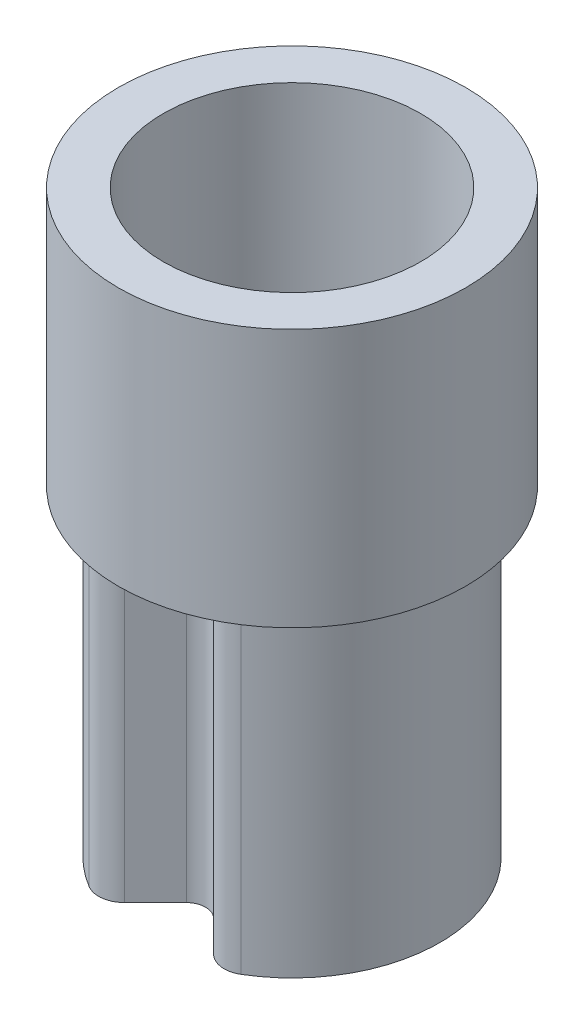
ISO-10303-21;
HEADER;
FILE_DESCRIPTION(('STEP AP214'),'2;1');
FILE_NAME('part.step','',(''),(''),'','','');
FILE_SCHEMA(('AUTOMOTIVE_DESIGN { 1 0 10303 214 1 1 1 1 }'));
ENDSEC;
DATA;
#1=APPLICATION_CONTEXT('core data for automotive mechanical design processes');
#2=APPLICATION_PROTOCOL_DEFINITION('international standard','automotive_design',2000,#1);
#3=PRODUCT_CONTEXT('',#1,'mechanical');
#4=PRODUCT('Part','Part','',(#3));
#5=PRODUCT_RELATED_PRODUCT_CATEGORY('part','',(#4));
#6=PRODUCT_DEFINITION_FORMATION('','',#4);
#7=PRODUCT_DEFINITION_CONTEXT('part definition',#1,'design');
#8=PRODUCT_DEFINITION('design','',#6,#7);
#9=PRODUCT_DEFINITION_SHAPE('','',#8);
#10=(LENGTH_UNIT() NAMED_UNIT(*) SI_UNIT(.MILLI.,.METRE.));
#11=(NAMED_UNIT(*) PLANE_ANGLE_UNIT() SI_UNIT($,.RADIAN.));
#12=(NAMED_UNIT(*) SI_UNIT($,.STERADIAN.) SOLID_ANGLE_UNIT());
#13=UNCERTAINTY_MEASURE_WITH_UNIT(LENGTH_MEASURE(1.E-05),#10,'distance_accuracy_value','');
#14=(GEOMETRIC_REPRESENTATION_CONTEXT(3) GLOBAL_UNCERTAINTY_ASSIGNED_CONTEXT((#13)) GLOBAL_UNIT_ASSIGNED_CONTEXT((#10,
#11,#12)) REPRESENTATION_CONTEXT('',''));
#15=CARTESIAN_POINT('',(0.,0.,0.));
#16=DIRECTION('',(0.,0.,1.));
#17=DIRECTION('',(1.,0.,0.));
#18=AXIS2_PLACEMENT_3D('',#15,#16,#17);
#19=CARTESIAN_POINT('',(0.,2.5,0.822132034355964));
#20=DIRECTION('',(0.,1.,0.));
#21=DIRECTION('',(0.,0.,1.));
#22=AXIS2_PLACEMENT_3D('',#19,#20,#21);
#23=PLANE('',#22);
#24=DIRECTION('',(0.707106781186548,0.,0.707106781186548));
#25=VECTOR('',#24,1.);
#26=CARTESIAN_POINT('',(0.106066017177983,2.5,0.716066017177983));
#27=LINE('',#26,#25);
#28=CARTESIAN_POINT('',(0.106066017177983,2.5,0.716066017177983));
#29=VERTEX_POINT('',#28);
#30=CARTESIAN_POINT('',(0.332945922473057,2.5,0.942945922473057));
#31=VERTEX_POINT('',#30);
#32=EDGE_CURVE('E168',#29,#31,#27,.T.);
#33=ORIENTED_EDGE('',*,*,#32,.T.);
#34=CARTESIAN_POINT('',(0.,2.5,0.));
#35=DIRECTION('',(0.,1.,0.));
#36=DIRECTION('',(0.,0.,1.));
#37=AXIS2_PLACEMENT_3D('',#34,#35,#36);
#38=CIRCLE('',#37,1.);
#39=CARTESIAN_POINT('',(0.513633561053512,2.5,0.858009653185492));
#40=VERTEX_POINT('',#39);
#41=EDGE_CURVE('E151',#31,#40,#38,.T.);
#42=ORIENTED_EDGE('',*,*,#41,.T.);
#43=CARTESIAN_POINT('',(0.487951883000837,2.5,0.815109170526217));
#44=DIRECTION('',(0.,1.,0.));
#45=DIRECTION('',(0.,0.,1.));
#46=AXIS2_PLACEMENT_3D('',#43,#44,#45);
#47=CIRCLE('',#46,0.05);
#48=CARTESIAN_POINT('',(0.452596543941509,2.5,0.850464509585545));
#49=VERTEX_POINT('',#48);
#50=EDGE_CURVE('E208',#40,#49,#47,.F.);
#51=ORIENTED_EDGE('',*,*,#50,.T.);
#52=DIRECTION('',(0.707106781186548,0.,0.707106781186547));
#53=VECTOR('',#52,1.);
#54=CARTESIAN_POINT('',(0.212132034355966,2.5,0.610000000000001));
#55=LINE('',#54,#53);
#56=CARTESIAN_POINT('',(0.212132034355966,2.5,0.610000000000002));
#57=VERTEX_POINT('',#56);
#58=EDGE_CURVE('E241',#57,#49,#55,.T.);
#59=ORIENTED_EDGE('',*,*,#58,.F.);
#60=CARTESIAN_POINT('',(0.,2.5,0.822132034355964));
#61=DIRECTION('',(0.,-1.,0.));
#62=DIRECTION('',(0.,0.,1.));
#63=AXIS2_PLACEMENT_3D('',#60,#61,#62);
#64=CIRCLE('',#63,0.3);
#65=CARTESIAN_POINT('',(-0.212132034355965,2.5,0.610000000000001));
#66=VERTEX_POINT('',#65);
#67=EDGE_CURVE('E237',#66,#57,#64,.T.);
#68=ORIENTED_EDGE('',*,*,#67,.F.);
#69=DIRECTION('',(0.707106781186547,0.,-0.707106781186548));
#70=VECTOR('',#69,1.);
#71=CARTESIAN_POINT('',(-0.479612456619358,2.5,0.877480422263394));
#72=LINE('',#71,#70);
#73=CARTESIAN_POINT('',(-0.452596543941509,2.5,0.850464509585545));
#74=VERTEX_POINT('',#73);
#75=EDGE_CURVE('E235',#74,#66,#72,.T.);
#76=ORIENTED_EDGE('',*,*,#75,.F.);
#77=CARTESIAN_POINT('',(-0.487951883000836,2.5,0.815109170526217));
#78=DIRECTION('',(0.,1.,0.));
#79=DIRECTION('',(0.,0.,1.));
#80=AXIS2_PLACEMENT_3D('',#77,#78,#79);
#81=CIRCLE('',#80,0.05);
#82=CARTESIAN_POINT('',(-0.513633561053512,2.5,0.858009653185492));
#83=VERTEX_POINT('',#82);
#84=EDGE_CURVE('E211',#74,#83,#81,.F.);
#85=ORIENTED_EDGE('',*,*,#84,.T.);
#86=CARTESIAN_POINT('',(-0.332945922473057,2.5,0.942945922473057));
#87=VERTEX_POINT('',#86);
#88=EDGE_CURVE('E14',#83,#87,#38,.T.);
#89=ORIENTED_EDGE('',*,*,#88,.T.);
#90=DIRECTION('',(0.707106781186547,0.,-0.707106781186548));
#91=VECTOR('',#90,1.);
#92=CARTESIAN_POINT('',(-0.448807004477936,2.5,1.05880700447794));
#93=LINE('',#92,#91);
#94=CARTESIAN_POINT('',(-0.106066017177983,2.5,0.716066017177983));
#95=VERTEX_POINT('',#94);
#96=EDGE_CURVE('E178',#87,#95,#93,.T.);
#97=ORIENTED_EDGE('',*,*,#96,.T.);
#98=CARTESIAN_POINT('',(0.,2.5,0.822132034355964));
#99=DIRECTION('',(0.,-1.,0.));
#100=DIRECTION('',(0.,0.,1.));
#101=AXIS2_PLACEMENT_3D('',#98,#99,#100);
#102=CIRCLE('',#101,0.15);
#103=EDGE_CURVE('E173',#95,#29,#102,.T.);
#104=ORIENTED_EDGE('',*,*,#103,.T.);
#105=EDGE_LOOP('',(#33,#42,#51,#59,#68,#76,#85,#89,#97,#104));
#106=FACE_BOUND('',#105,.T.);
#107=ADVANCED_FACE('F50',(#106),#23,.T.);
#108=CARTESIAN_POINT('',(0.,0.,0.822132034355964));
#109=DIRECTION('',(0.,1.,0.));
#110=DIRECTION('',(0.,0.,1.));
#111=AXIS2_PLACEMENT_3D('',#108,#109,#110);
#112=PLANE('',#111);
#113=CARTESIAN_POINT('',(0.,0.,0.));
#114=DIRECTION('',(0.,1.,0.));
#115=DIRECTION('',(0.,0.,1.));
#116=AXIS2_PLACEMENT_3D('',#113,#114,#115);
#117=CIRCLE('',#116,1.15);
#118=CARTESIAN_POINT('',(0.590678595211539,0.,0.986711101163316));
#119=VERTEX_POINT('',#118);
#120=CARTESIAN_POINT('',(-0.590678595211538,0.,0.986711101163316));
#121=VERTEX_POINT('',#120);
#122=EDGE_CURVE('E191',#119,#121,#117,.T.);
#123=ORIENTED_EDGE('',*,*,#122,.F.);
#124=CARTESIAN_POINT('',(0.487951883000837,0.,0.815109170526217));
#125=DIRECTION('',(0.,1.,0.));
#126=DIRECTION('',(0.,0.,1.));
#127=AXIS2_PLACEMENT_3D('',#124,#125,#126);
#128=CIRCLE('',#127,0.2);
#129=CARTESIAN_POINT('',(0.346530526763527,0.,0.956530526763527));
#130=VERTEX_POINT('',#129);
#131=EDGE_CURVE('E75',#119,#130,#128,.F.);
#132=ORIENTED_EDGE('',*,*,#131,.T.);
#133=DIRECTION('',(0.707106781186548,0.,0.707106781186548));
#134=VECTOR('',#133,1.);
#135=CARTESIAN_POINT('',(0.106066017177983,0.,0.716066017177983));
#136=LINE('',#135,#134);
#137=CARTESIAN_POINT('',(0.106066017177983,0.,0.716066017177983));
#138=VERTEX_POINT('',#137);
#139=EDGE_CURVE('E188',#138,#130,#136,.T.);
#140=ORIENTED_EDGE('',*,*,#139,.F.);
#141=CARTESIAN_POINT('',(0.,0.,0.822132034355964));
#142=DIRECTION('',(0.,-1.,0.));
#143=DIRECTION('',(0.,0.,1.));
#144=AXIS2_PLACEMENT_3D('',#141,#142,#143);
#145=CIRCLE('',#144,0.15);
#146=CARTESIAN_POINT('',(-0.106066017177983,0.,0.716066017177983));
#147=VERTEX_POINT('',#146);
#148=EDGE_CURVE('E185',#147,#138,#145,.T.);
#149=ORIENTED_EDGE('',*,*,#148,.F.);
#150=DIRECTION('',(0.707106781186547,0.,-0.707106781186548));
#151=VECTOR('',#150,1.);
#152=CARTESIAN_POINT('',(-0.448807004477936,0.,1.05880700447794));
#153=LINE('',#152,#151);
#154=CARTESIAN_POINT('',(-0.346530526763527,0.,0.956530526763527));
#155=VERTEX_POINT('',#154);
#156=EDGE_CURVE('E194',#155,#147,#153,.T.);
#157=ORIENTED_EDGE('',*,*,#156,.F.);
#158=CARTESIAN_POINT('',(-0.487951883000836,0.,0.815109170526217));
#159=DIRECTION('',(0.,1.,0.));
#160=DIRECTION('',(0.,0.,1.));
#161=AXIS2_PLACEMENT_3D('',#158,#159,#160);
#162=CIRCLE('',#161,0.2);
#163=EDGE_CURVE('E218',#155,#121,#162,.F.);
#164=ORIENTED_EDGE('',*,*,#163,.T.);
#165=EDGE_LOOP('',(#123,#132,#140,#149,#157,#164));
#166=FACE_BOUND('',#165,.T.);
#167=DIRECTION('',(0.707106781186548,0.,0.707106781186547));
#168=VECTOR('',#167,1.);
#169=CARTESIAN_POINT('',(0.212132034355966,0.,0.610000000000001));
#170=LINE('',#169,#168);
#171=CARTESIAN_POINT('',(0.212132034355966,0.,0.610000000000002));
#172=VERTEX_POINT('',#171);
#173=CARTESIAN_POINT('',(0.452596543941509,0.,0.850464509585545));
#174=VERTEX_POINT('',#173);
#175=EDGE_CURVE('E238',#172,#174,#170,.T.);
#176=ORIENTED_EDGE('',*,*,#175,.T.);
#177=CARTESIAN_POINT('',(0.487951883000837,0.,0.815109170526217));
#178=DIRECTION('',(0.,1.,0.));
#179=DIRECTION('',(0.,0.,1.));
#180=AXIS2_PLACEMENT_3D('',#177,#178,#179);
#181=CIRCLE('',#180,0.05);
#182=CARTESIAN_POINT('',(0.513633561053512,0.,0.858009653185492));
#183=VERTEX_POINT('',#182);
#184=EDGE_CURVE('E206',#174,#183,#181,.T.);
#185=ORIENTED_EDGE('',*,*,#184,.T.);
#186=CARTESIAN_POINT('',(0.,0.,0.));
#187=DIRECTION('',(0.,1.,0.));
#188=DIRECTION('',(0.,0.,1.));
#189=AXIS2_PLACEMENT_3D('',#186,#187,#188);
#190=CIRCLE('',#189,1.);
#191=CARTESIAN_POINT('',(-0.513633561053512,0.,0.858009653185492));
#192=VERTEX_POINT('',#191);
#193=EDGE_CURVE('E245',#183,#192,#190,.T.);
#194=ORIENTED_EDGE('',*,*,#193,.T.);
#195=CARTESIAN_POINT('',(-0.487951883000836,0.,0.815109170526217));
#196=DIRECTION('',(0.,1.,0.));
#197=DIRECTION('',(0.,0.,1.));
#198=AXIS2_PLACEMENT_3D('',#195,#196,#197);
#199=CIRCLE('',#198,0.05);
#200=CARTESIAN_POINT('',(-0.452596543941509,0.,0.850464509585545));
#201=VERTEX_POINT('',#200);
#202=EDGE_CURVE('E209',#192,#201,#199,.T.);
#203=ORIENTED_EDGE('',*,*,#202,.T.);
#204=DIRECTION('',(0.707106781186547,0.,-0.707106781186548));
#205=VECTOR('',#204,1.);
#206=CARTESIAN_POINT('',(-0.479612456619358,0.,0.877480422263394));
#207=LINE('',#206,#205);
#208=CARTESIAN_POINT('',(-0.212132034355965,0.,0.610000000000001));
#209=VERTEX_POINT('',#208);
#210=EDGE_CURVE('E248',#201,#209,#207,.T.);
#211=ORIENTED_EDGE('',*,*,#210,.T.);
#212=CARTESIAN_POINT('',(0.,0.,0.822132034355964));
#213=DIRECTION('',(0.,-1.,0.));
#214=DIRECTION('',(0.,0.,1.));
#215=AXIS2_PLACEMENT_3D('',#212,#213,#214);
#216=CIRCLE('',#215,0.3);
#217=EDGE_CURVE('E251',#209,#172,#216,.T.);
#218=ORIENTED_EDGE('',*,*,#217,.T.);
#219=EDGE_LOOP('',(#176,#185,#194,#203,#211,#218));
#220=FACE_BOUND('',#219,.T.);
#221=ADVANCED_FACE('F269',(#166,#220),#112,.F.);
#222=CARTESIAN_POINT('',(0.,2.5,0.822132034355964));
#223=DIRECTION('',(0.,-1.,0.));
#224=DIRECTION('',(0.,0.,-1.));
#225=AXIS2_PLACEMENT_3D('',#222,#223,#224);
#226=CYLINDRICAL_SURFACE('',#225,0.15);
#227=ORIENTED_EDGE('',*,*,#148,.T.);
#228=DIRECTION('',(0.,-1.,0.));
#229=VECTOR('',#228,1.);
#230=CARTESIAN_POINT('',(0.106066017177983,2.5,0.716066017177983));
#231=LINE('',#230,#229);
#232=EDGE_CURVE('E198',#29,#138,#231,.T.);
#233=ORIENTED_EDGE('',*,*,#232,.F.);
#234=ORIENTED_EDGE('',*,*,#103,.F.);
#235=DIRECTION('',(0.,-1.,0.));
#236=VECTOR('',#235,1.);
#237=CARTESIAN_POINT('',(-0.106066017177983,2.5,0.716066017177983));
#238=LINE('',#237,#236);
#239=EDGE_CURVE('E184',#95,#147,#238,.T.);
#240=ORIENTED_EDGE('',*,*,#239,.T.);
#241=EDGE_LOOP('',(#227,#233,#234,#240));
#242=FACE_BOUND('',#241,.T.);
#243=ADVANCED_FACE('F305',(#242),#226,.F.);
#244=CARTESIAN_POINT('',(0.106066017177983,2.5,0.716066017177983));
#245=DIRECTION('',(0.707106781186548,0.,-0.707106781186548));
#246=DIRECTION('',(-0.707106781186548,0.,-0.707106781186548));
#247=AXIS2_PLACEMENT_3D('',#244,#245,#246);
#248=PLANE('',#247);
#249=ORIENTED_EDGE('',*,*,#139,.T.);
#250=DIRECTION('',(0.,-1.,0.));
#251=VECTOR('',#250,1.);
#252=CARTESIAN_POINT('',(0.346530526763527,2.5,0.956530526763527));
#253=LINE('',#252,#251);
#254=CARTESIAN_POINT('',(0.346530526763527,2.5,0.956530526763527));
#255=VERTEX_POINT('',#254);
#256=EDGE_CURVE('E171',#130,#255,#253,.F.);
#257=ORIENTED_EDGE('',*,*,#256,.T.);
#258=EDGE_CURVE('E147',#31,#255,#27,.T.);
#259=ORIENTED_EDGE('',*,*,#258,.F.);
#260=ORIENTED_EDGE('',*,*,#32,.F.);
#261=ORIENTED_EDGE('',*,*,#232,.T.);
#262=EDGE_LOOP('',(#249,#257,#259,#260,#261));
#263=FACE_BOUND('',#262,.T.);
#264=ADVANCED_FACE('F166',(#263),#248,.F.);
#265=CARTESIAN_POINT('',(0.,2.5,0.));
#266=DIRECTION('',(0.,-1.,0.));
#267=DIRECTION('',(0.,0.,-1.));
#268=AXIS2_PLACEMENT_3D('',#265,#266,#267);
#269=CYLINDRICAL_SURFACE('',#268,1.15);
#270=CARTESIAN_POINT('',(0.,2.5,0.));
#271=DIRECTION('',(0.,1.,0.));
#272=DIRECTION('',(0.,0.,1.));
#273=AXIS2_PLACEMENT_3D('',#270,#271,#272);
#274=CIRCLE('',#273,1.15);
#275=CARTESIAN_POINT('',(0.590678595211539,2.5,0.986711101163316));
#276=VERTEX_POINT('',#275);
#277=CARTESIAN_POINT('',(-0.590678595211538,2.5,0.986711101163316));
#278=VERTEX_POINT('',#277);
#279=EDGE_CURVE('E177',#276,#278,#274,.T.);
#280=ORIENTED_EDGE('',*,*,#279,.F.);
#281=DIRECTION('',(0.,-1.,0.));
#282=VECTOR('',#281,1.);
#283=CARTESIAN_POINT('',(0.590678595211539,2.5,0.986711101163316));
#284=LINE('',#283,#282);
#285=EDGE_CURVE('E215',#276,#119,#284,.T.);
#286=ORIENTED_EDGE('',*,*,#285,.T.);
#287=ORIENTED_EDGE('',*,*,#122,.T.);
#288=DIRECTION('',(0.,-1.,0.));
#289=VECTOR('',#288,1.);
#290=CARTESIAN_POINT('',(-0.590678595211539,2.5,0.986711101163316));
#291=LINE('',#290,#289);
#292=EDGE_CURVE('E212',#121,#278,#291,.F.);
#293=ORIENTED_EDGE('',*,*,#292,.T.);
#294=EDGE_LOOP('',(#280,#286,#287,#293));
#295=FACE_BOUND('',#294,.T.);
#296=ADVANCED_FACE('F313',(#295),#269,.T.);
#297=CARTESIAN_POINT('',(-0.448807004477936,2.5,1.05880700447794));
#298=DIRECTION('',(-0.707106781186548,0.,-0.707106781186547));
#299=DIRECTION('',(-0.707106781186547,0.,0.707106781186548));
#300=AXIS2_PLACEMENT_3D('',#297,#298,#299);
#301=PLANE('',#300);
#302=CARTESIAN_POINT('',(-0.346530526763527,2.5,0.956530526763527));
#303=VERTEX_POINT('',#302);
#304=EDGE_CURVE('E150',#303,#87,#93,.T.);
#305=ORIENTED_EDGE('',*,*,#304,.F.);
#306=DIRECTION('',(0.,-1.,0.));
#307=VECTOR('',#306,1.);
#308=CARTESIAN_POINT('',(-0.346530526763527,2.5,0.956530526763527));
#309=LINE('',#308,#307);
#310=EDGE_CURVE('E59',#303,#155,#309,.T.);
#311=ORIENTED_EDGE('',*,*,#310,.T.);
#312=ORIENTED_EDGE('',*,*,#156,.T.);
#313=ORIENTED_EDGE('',*,*,#239,.F.);
#314=ORIENTED_EDGE('',*,*,#96,.F.);
#315=EDGE_LOOP('',(#305,#311,#312,#313,#314));
#316=FACE_BOUND('',#315,.T.);
#317=ADVANCED_FACE('F310',(#316),#301,.F.);
#318=CARTESIAN_POINT('',(0.,2.5,0.));
#319=DIRECTION('',(0.,-1.,0.));
#320=DIRECTION('',(0.,0.,-1.));
#321=AXIS2_PLACEMENT_3D('',#318,#319,#320);
#322=CYLINDRICAL_SURFACE('',#321,1.);
#323=ORIENTED_EDGE('',*,*,#193,.F.);
#324=DIRECTION('',(0.,-1.,0.));
#325=VECTOR('',#324,1.);
#326=CARTESIAN_POINT('',(0.513633561053512,2.5,0.858009653185492));
#327=LINE('',#326,#325);
#328=EDGE_CURVE('E159',#183,#40,#327,.F.);
#329=ORIENTED_EDGE('',*,*,#328,.T.);
#330=ORIENTED_EDGE('',*,*,#41,.F.);
#331=EDGE_CURVE('E67',#87,#31,#38,.T.);
#332=ORIENTED_EDGE('',*,*,#331,.F.);
#333=ORIENTED_EDGE('',*,*,#88,.F.);
#334=DIRECTION('',(0.,-1.,0.));
#335=VECTOR('',#334,1.);
#336=CARTESIAN_POINT('',(-0.513633561053512,2.5,0.858009653185492));
#337=LINE('',#336,#335);
#338=EDGE_CURVE('E203',#83,#192,#337,.T.);
#339=ORIENTED_EDGE('',*,*,#338,.T.);
#340=EDGE_LOOP('',(#323,#329,#330,#332,#333,#339));
#341=FACE_BOUND('',#340,.T.);
#342=CARTESIAN_POINT('',(0.,4.51,0.));
#343=DIRECTION('',(0.,1.,0.));
#344=DIRECTION('',(0.,0.,1.));
#345=AXIS2_PLACEMENT_3D('',#342,#343,#344);
#346=CIRCLE('',#345,1.);
#347=CARTESIAN_POINT('',(0.,4.51,1.));
#348=VERTEX_POINT('',#347);
#349=EDGE_CURVE('E152',#348,#348,#346,.T.);
#350=ORIENTED_EDGE('',*,*,#349,.T.);
#351=EDGE_LOOP('',(#350));
#352=FACE_BOUND('',#351,.T.);
#353=ADVANCED_FACE('F156',(#341,#352),#322,.F.);
#354=CARTESIAN_POINT('',(-0.479612456619358,2.5,0.877480422263394));
#355=DIRECTION('',(-0.707106781186548,0.,-0.707106781186547));
#356=DIRECTION('',(-0.707106781186547,0.,0.707106781186548));
#357=AXIS2_PLACEMENT_3D('',#354,#355,#356);
#358=PLANE('',#357);
#359=ORIENTED_EDGE('',*,*,#210,.F.);
#360=DIRECTION('',(0.,1.,0.));
#361=VECTOR('',#360,1.);
#362=CARTESIAN_POINT('',(-0.452596543941509,2.5,0.850464509585545));
#363=LINE('',#362,#361);
#364=EDGE_CURVE('E204',#201,#74,#363,.T.);
#365=ORIENTED_EDGE('',*,*,#364,.T.);
#366=ORIENTED_EDGE('',*,*,#75,.T.);
#367=DIRECTION('',(0.,-1.,0.));
#368=VECTOR('',#367,1.);
#369=CARTESIAN_POINT('',(-0.212132034355965,2.5,0.610000000000001));
#370=LINE('',#369,#368);
#371=EDGE_CURVE('E189',#66,#209,#370,.T.);
#372=ORIENTED_EDGE('',*,*,#371,.T.);
#373=EDGE_LOOP('',(#359,#365,#366,#372));
#374=FACE_BOUND('',#373,.T.);
#375=ADVANCED_FACE('F261',(#374),#358,.T.);
#376=CARTESIAN_POINT('',(0.,2.5,0.822132034355964));
#377=DIRECTION('',(0.,-1.,0.));
#378=DIRECTION('',(0.,0.,-1.));
#379=AXIS2_PLACEMENT_3D('',#376,#377,#378);
#380=CYLINDRICAL_SURFACE('',#379,0.3);
#381=ORIENTED_EDGE('',*,*,#217,.F.);
#382=ORIENTED_EDGE('',*,*,#371,.F.);
#383=ORIENTED_EDGE('',*,*,#67,.T.);
#384=DIRECTION('',(0.,-1.,0.));
#385=VECTOR('',#384,1.);
#386=CARTESIAN_POINT('',(0.212132034355966,2.5,0.610000000000002));
#387=LINE('',#386,#385);
#388=EDGE_CURVE('E244',#57,#172,#387,.T.);
#389=ORIENTED_EDGE('',*,*,#388,.T.);
#390=EDGE_LOOP('',(#381,#382,#383,#389));
#391=FACE_BOUND('',#390,.T.);
#392=ADVANCED_FACE('F266',(#391),#380,.T.);
#393=CARTESIAN_POINT('',(0.212132034355966,2.5,0.610000000000001));
#394=DIRECTION('',(0.707106781186547,0.,-0.707106781186548));
#395=DIRECTION('',(-0.707106781186548,0.,-0.707106781186547));
#396=AXIS2_PLACEMENT_3D('',#393,#394,#395);
#397=PLANE('',#396);
#398=ORIENTED_EDGE('',*,*,#58,.T.);
#399=DIRECTION('',(0.,1.,0.));
#400=VECTOR('',#399,1.);
#401=CARTESIAN_POINT('',(0.452596543941509,0.,0.850464509585545));
#402=LINE('',#401,#400);
#403=EDGE_CURVE('E200',#49,#174,#402,.F.);
#404=ORIENTED_EDGE('',*,*,#403,.T.);
#405=ORIENTED_EDGE('',*,*,#175,.F.);
#406=ORIENTED_EDGE('',*,*,#388,.F.);
#407=EDGE_LOOP('',(#398,#404,#405,#406));
#408=FACE_BOUND('',#407,.T.);
#409=ADVANCED_FACE('F288',(#408),#397,.T.);
#410=CARTESIAN_POINT('',(0.487951883000837,2.5,0.815109170526217));
#411=DIRECTION('',(0.,-1.,0.));
#412=DIRECTION('',(0.,0.,-1.));
#413=AXIS2_PLACEMENT_3D('',#410,#411,#412);
#414=CYLINDRICAL_SURFACE('',#413,0.05);
#415=ORIENTED_EDGE('',*,*,#50,.F.);
#416=ORIENTED_EDGE('',*,*,#328,.F.);
#417=ORIENTED_EDGE('',*,*,#184,.F.);
#418=ORIENTED_EDGE('',*,*,#403,.F.);
#419=EDGE_LOOP('',(#415,#416,#417,#418));
#420=FACE_BOUND('',#419,.T.);
#421=ADVANCED_FACE('F289',(#420),#414,.F.);
#422=CARTESIAN_POINT('',(-0.487951883000836,2.5,0.815109170526217));
#423=DIRECTION('',(0.,-1.,0.));
#424=DIRECTION('',(0.,0.,-1.));
#425=AXIS2_PLACEMENT_3D('',#422,#423,#424);
#426=CYLINDRICAL_SURFACE('',#425,0.05);
#427=ORIENTED_EDGE('',*,*,#84,.F.);
#428=ORIENTED_EDGE('',*,*,#364,.F.);
#429=ORIENTED_EDGE('',*,*,#202,.F.);
#430=ORIENTED_EDGE('',*,*,#338,.F.);
#431=EDGE_LOOP('',(#427,#428,#429,#430));
#432=FACE_BOUND('',#431,.T.);
#433=ADVANCED_FACE('F274',(#432),#426,.F.);
#434=CARTESIAN_POINT('',(0.487951883000837,2.5,0.815109170526217));
#435=DIRECTION('',(0.,-1.,0.));
#436=DIRECTION('',(0.,0.,-1.));
#437=AXIS2_PLACEMENT_3D('',#434,#435,#436);
#438=CYLINDRICAL_SURFACE('',#437,0.2);
#439=CARTESIAN_POINT('',(0.487951883000837,2.5,0.815109170526217));
#440=DIRECTION('',(0.,1.,0.));
#441=DIRECTION('',(0.,0.,1.));
#442=AXIS2_PLACEMENT_3D('',#439,#440,#441);
#443=CIRCLE('',#442,0.2);
#444=EDGE_CURVE('E224',#255,#276,#443,.T.);
#445=ORIENTED_EDGE('',*,*,#444,.F.);
#446=ORIENTED_EDGE('',*,*,#256,.F.);
#447=ORIENTED_EDGE('',*,*,#131,.F.);
#448=ORIENTED_EDGE('',*,*,#285,.F.);
#449=EDGE_LOOP('',(#445,#446,#447,#448));
#450=FACE_BOUND('',#449,.T.);
#451=ADVANCED_FACE('F296',(#450),#438,.T.);
#452=CARTESIAN_POINT('',(-0.487951883000836,2.5,0.815109170526217));
#453=DIRECTION('',(0.,-1.,0.));
#454=DIRECTION('',(0.,0.,-1.));
#455=AXIS2_PLACEMENT_3D('',#452,#453,#454);
#456=CYLINDRICAL_SURFACE('',#455,0.2);
#457=CARTESIAN_POINT('',(-0.487951883000836,2.5,0.815109170526217));
#458=DIRECTION('',(0.,1.,0.));
#459=DIRECTION('',(0.,0.,1.));
#460=AXIS2_PLACEMENT_3D('',#457,#458,#459);
#461=CIRCLE('',#460,0.2);
#462=EDGE_CURVE('E222',#278,#303,#461,.T.);
#463=ORIENTED_EDGE('',*,*,#462,.F.);
#464=ORIENTED_EDGE('',*,*,#292,.F.);
#465=ORIENTED_EDGE('',*,*,#163,.F.);
#466=ORIENTED_EDGE('',*,*,#310,.F.);
#467=EDGE_LOOP('',(#463,#464,#465,#466));
#468=FACE_BOUND('',#467,.T.);
#469=ADVANCED_FACE('F52',(#468),#456,.T.);
#470=CARTESIAN_POINT('',(0.,2.5,0.));
#471=DIRECTION('',(0.,1.,0.));
#472=DIRECTION('',(0.,0.,1.));
#473=AXIS2_PLACEMENT_3D('',#470,#471,#472);
#474=PLANE('',#473);
#475=CARTESIAN_POINT('',(0.,2.5,0.));
#476=DIRECTION('',(0.,1.,0.));
#477=DIRECTION('',(0.,0.,1.));
#478=AXIS2_PLACEMENT_3D('',#475,#476,#477);
#479=CIRCLE('',#478,1.35);
#480=CARTESIAN_POINT('',(0.,2.5,1.35));
#481=VERTEX_POINT('',#480);
#482=EDGE_CURVE('E163',#481,#481,#479,.T.);
#483=ORIENTED_EDGE('',*,*,#482,.F.);
#484=EDGE_LOOP('',(#483));
#485=FACE_BOUND('',#484,.T.);
#486=ORIENTED_EDGE('',*,*,#331,.T.);
#487=ORIENTED_EDGE('',*,*,#258,.T.);
#488=ORIENTED_EDGE('',*,*,#444,.T.);
#489=ORIENTED_EDGE('',*,*,#279,.T.);
#490=ORIENTED_EDGE('',*,*,#462,.T.);
#491=ORIENTED_EDGE('',*,*,#304,.T.);
#492=EDGE_LOOP('',(#486,#487,#488,#489,#490,#491));
#493=FACE_BOUND('',#492,.T.);
#494=ADVANCED_FACE('F145',(#485,#493),#474,.F.);
#495=CARTESIAN_POINT('',(0.,12.8383766184074,0.));
#496=DIRECTION('',(0.,-1.,0.));
#497=DIRECTION('',(0.,0.,-1.));
#498=AXIS2_PLACEMENT_3D('',#495,#496,#497);
#499=CYLINDRICAL_SURFACE('',#498,1.35);
#500=ORIENTED_EDGE('',*,*,#482,.T.);
#501=EDGE_LOOP('',(#500));
#502=FACE_BOUND('',#501,.T.);
#503=CARTESIAN_POINT('',(0.,4.51,0.));
#504=DIRECTION('',(0.,1.,0.));
#505=DIRECTION('',(0.,0.,1.));
#506=AXIS2_PLACEMENT_3D('',#503,#504,#505);
#507=CIRCLE('',#506,1.35);
#508=CARTESIAN_POINT('',(0.,4.51,1.35));
#509=VERTEX_POINT('',#508);
#510=EDGE_CURVE('E249',#509,#509,#507,.T.);
#511=ORIENTED_EDGE('',*,*,#510,.F.);
#512=EDGE_LOOP('',(#511));
#513=FACE_BOUND('',#512,.T.);
#514=ADVANCED_FACE('F339',(#502,#513),#499,.T.);
#515=CARTESIAN_POINT('',(0.,4.51,0.822132034355964));
#516=DIRECTION('',(0.,1.,0.));
#517=DIRECTION('',(0.,0.,1.));
#518=AXIS2_PLACEMENT_3D('',#515,#516,#517);
#519=PLANE('',#518);
#520=ORIENTED_EDGE('',*,*,#349,.F.);
#521=EDGE_LOOP('',(#520));
#522=FACE_BOUND('',#521,.T.);
#523=ORIENTED_EDGE('',*,*,#510,.T.);
#524=EDGE_LOOP('',(#523));
#525=FACE_BOUND('',#524,.T.);
#526=ADVANCED_FACE('F421',(#522,#525),#519,.T.);
#527=CLOSED_SHELL('',(#107,#221,#243,#264,#296,#317,#353,#375,#392,#409,#421,#433,#451,#469,
#494,#514,#526));
#528=MANIFOLD_SOLID_BREP('B2',#527);
#529=ADVANCED_BREP_SHAPE_REPRESENTATION('',(#18,#528),#14);
#530=SHAPE_DEFINITION_REPRESENTATION(#9,#529);
ENDSEC;
END-ISO-10303-21;
